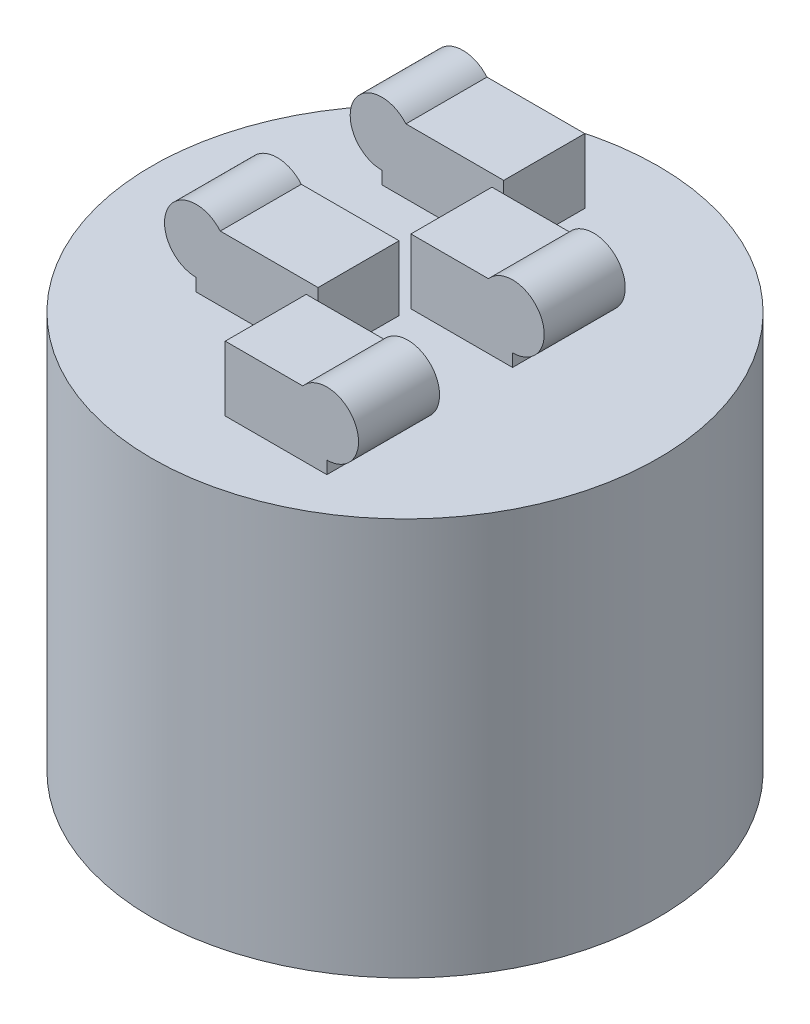
ISO-10303-21;
HEADER;
FILE_DESCRIPTION(('STEP AP214'),'2;1');
FILE_NAME('part.step','',(''),(''),'','','');
FILE_SCHEMA(('AUTOMOTIVE_DESIGN { 1 0 10303 214 1 1 1 1 }'));
ENDSEC;
DATA;
#1=APPLICATION_CONTEXT('core data for automotive mechanical design processes');
#2=APPLICATION_PROTOCOL_DEFINITION('international standard','automotive_design',2000,#1);
#3=PRODUCT_CONTEXT('',#1,'mechanical');
#4=PRODUCT('Part','Part','',(#3));
#5=PRODUCT_RELATED_PRODUCT_CATEGORY('part','',(#4));
#6=PRODUCT_DEFINITION_FORMATION('','',#4);
#7=PRODUCT_DEFINITION_CONTEXT('part definition',#1,'design');
#8=PRODUCT_DEFINITION('design','',#6,#7);
#9=PRODUCT_DEFINITION_SHAPE('','',#8);
#10=(LENGTH_UNIT() NAMED_UNIT(*) SI_UNIT(.MILLI.,.METRE.));
#11=(NAMED_UNIT(*) PLANE_ANGLE_UNIT() SI_UNIT($,.RADIAN.));
#12=(NAMED_UNIT(*) SI_UNIT($,.STERADIAN.) SOLID_ANGLE_UNIT());
#13=UNCERTAINTY_MEASURE_WITH_UNIT(LENGTH_MEASURE(1.E-05),#10,'distance_accuracy_value','');
#14=(GEOMETRIC_REPRESENTATION_CONTEXT(3) GLOBAL_UNCERTAINTY_ASSIGNED_CONTEXT((#13)) GLOBAL_UNIT_ASSIGNED_CONTEXT((#10,
#11,#12)) REPRESENTATION_CONTEXT('',''));
#15=CARTESIAN_POINT('',(0.,0.,0.));
#16=DIRECTION('',(0.,0.,1.));
#17=DIRECTION('',(1.,0.,0.));
#18=AXIS2_PLACEMENT_3D('',#15,#16,#17);
#19=CARTESIAN_POINT('',(0.,78.5,0.));
#20=DIRECTION('',(0.,1.,0.));
#21=DIRECTION('',(0.,0.,1.));
#22=AXIS2_PLACEMENT_3D('',#19,#20,#21);
#23=PLANE('',#22);
#24=DIRECTION('',(0.,0.,-1.));
#25=VECTOR('',#24,1.);
#26=CARTESIAN_POINT('',(20.07,78.5,35.495));
#27=LINE('',#26,#25);
#28=CARTESIAN_POINT('',(20.07,78.5,35.495));
#29=VERTEX_POINT('',#28);
#30=CARTESIAN_POINT('',(20.07,78.5,19.495));
#31=VERTEX_POINT('',#30);
#32=EDGE_CURVE('E242',#29,#31,#27,.T.);
#33=ORIENTED_EDGE('',*,*,#32,.F.);
#34=DIRECTION('',(1.,0.,0.));
#35=VECTOR('',#34,1.);
#36=CARTESIAN_POINT('',(0.,78.5,35.495));
#37=LINE('',#36,#35);
#38=CARTESIAN_POINT('',(0.,78.5,35.495));
#39=VERTEX_POINT('',#38);
#40=EDGE_CURVE('E214',#39,#29,#37,.T.);
#41=ORIENTED_EDGE('',*,*,#40,.F.);
#42=DIRECTION('',(0.,0.,-1.));
#43=VECTOR('',#42,1.);
#44=CARTESIAN_POINT('',(0.,78.5,35.495));
#45=LINE('',#44,#43);
#46=CARTESIAN_POINT('',(0.,78.5,19.495));
#47=VERTEX_POINT('',#46);
#48=EDGE_CURVE('E245',#39,#47,#45,.T.);
#49=ORIENTED_EDGE('',*,*,#48,.T.);
#50=DIRECTION('',(1.,0.,0.));
#51=VECTOR('',#50,1.);
#52=CARTESIAN_POINT('',(0.,78.5,19.495));
#53=LINE('',#52,#51);
#54=EDGE_CURVE('E227',#47,#31,#53,.T.);
#55=ORIENTED_EDGE('',*,*,#54,.T.);
#56=EDGE_LOOP('',(#33,#41,#49,#55));
#57=FACE_BOUND('',#56,.T.);
#58=DIRECTION('',(1.,0.,0.));
#59=VECTOR('',#58,1.);
#60=CARTESIAN_POINT('',(0.,78.5,-19.495));
#61=LINE('',#60,#59);
#62=CARTESIAN_POINT('',(-24.07,78.5,-19.495));
#63=VERTEX_POINT('',#62);
#64=CARTESIAN_POINT('',(0.,78.5,-19.495));
#65=VERTEX_POINT('',#64);
#66=EDGE_CURVE('E258',#63,#65,#61,.T.);
#67=ORIENTED_EDGE('',*,*,#66,.F.);
#68=DIRECTION('',(0.,0.,-1.));
#69=VECTOR('',#68,1.);
#70=CARTESIAN_POINT('',(-24.07,78.5,-19.495));
#71=LINE('',#70,#69);
#72=CARTESIAN_POINT('',(-24.07,78.5,-35.495));
#73=VERTEX_POINT('',#72);
#74=EDGE_CURVE('E273',#63,#73,#71,.T.);
#75=ORIENTED_EDGE('',*,*,#74,.T.);
#76=DIRECTION('',(1.,0.,0.));
#77=VECTOR('',#76,1.);
#78=CARTESIAN_POINT('',(0.,78.5,-35.495));
#79=LINE('',#78,#77);
#80=CARTESIAN_POINT('',(0.,78.5,-35.495));
#81=VERTEX_POINT('',#80);
#82=EDGE_CURVE('E252',#73,#81,#79,.T.);
#83=ORIENTED_EDGE('',*,*,#82,.T.);
#84=DIRECTION('',(0.,0.,-1.));
#85=VECTOR('',#84,1.);
#86=CARTESIAN_POINT('',(0.,78.5,-19.495));
#87=LINE('',#86,#85);
#88=EDGE_CURVE('E260',#65,#81,#87,.T.);
#89=ORIENTED_EDGE('',*,*,#88,.F.);
#90=EDGE_LOOP('',(#67,#75,#83,#89));
#91=FACE_BOUND('',#90,.T.);
#92=DIRECTION('',(1.,0.,0.));
#93=VECTOR('',#92,1.);
#94=CARTESIAN_POINT('',(0.,78.5,17.165));
#95=LINE('',#94,#93);
#96=CARTESIAN_POINT('',(-24.07,78.5,17.165));
#97=VERTEX_POINT('',#96);
#98=CARTESIAN_POINT('',(0.,78.5,17.165));
#99=VERTEX_POINT('',#98);
#100=EDGE_CURVE('E296',#97,#99,#95,.T.);
#101=ORIENTED_EDGE('',*,*,#100,.F.);
#102=DIRECTION('',(0.,0.,-1.));
#103=VECTOR('',#102,1.);
#104=CARTESIAN_POINT('',(-24.07,78.5,17.165));
#105=LINE('',#104,#103);
#106=CARTESIAN_POINT('',(-24.07,78.5,1.165));
#107=VERTEX_POINT('',#106);
#108=EDGE_CURVE('E311',#97,#107,#105,.T.);
#109=ORIENTED_EDGE('',*,*,#108,.T.);
#110=DIRECTION('',(1.,0.,0.));
#111=VECTOR('',#110,1.);
#112=CARTESIAN_POINT('',(0.,78.5,1.165));
#113=LINE('',#112,#111);
#114=CARTESIAN_POINT('',(0.,78.5,1.165));
#115=VERTEX_POINT('',#114);
#116=EDGE_CURVE('E290',#107,#115,#113,.T.);
#117=ORIENTED_EDGE('',*,*,#116,.T.);
#118=DIRECTION('',(0.,0.,-1.));
#119=VECTOR('',#118,1.);
#120=CARTESIAN_POINT('',(0.,78.5,17.165));
#121=LINE('',#120,#119);
#122=EDGE_CURVE('E298',#99,#115,#121,.T.);
#123=ORIENTED_EDGE('',*,*,#122,.F.);
#124=EDGE_LOOP('',(#101,#109,#117,#123));
#125=FACE_BOUND('',#124,.T.);
#126=CARTESIAN_POINT('',(0.,78.5,0.));
#127=DIRECTION('',(0.,1.,0.));
#128=DIRECTION('',(0.,0.,1.));
#129=AXIS2_PLACEMENT_3D('',#126,#127,#128);
#130=CIRCLE('',#129,50.);
#131=CARTESIAN_POINT('',(0.,78.5,50.));
#132=VERTEX_POINT('',#131);
#133=EDGE_CURVE('E11',#132,#132,#130,.T.);
#134=ORIENTED_EDGE('',*,*,#133,.T.);
#135=EDGE_LOOP('',(#134));
#136=FACE_BOUND('',#135,.T.);
#137=DIRECTION('',(0.,0.,-1.));
#138=VECTOR('',#137,1.);
#139=CARTESIAN_POINT('',(20.07,78.5,-1.165));
#140=LINE('',#139,#138);
#141=CARTESIAN_POINT('',(20.07,78.5,-1.165));
#142=VERTEX_POINT('',#141);
#143=CARTESIAN_POINT('',(20.07,78.5,-17.165));
#144=VERTEX_POINT('',#143);
#145=EDGE_CURVE('E53',#142,#144,#140,.T.);
#146=ORIENTED_EDGE('',*,*,#145,.F.);
#147=DIRECTION('',(1.,0.,0.));
#148=VECTOR('',#147,1.);
#149=CARTESIAN_POINT('',(0.,78.5,-1.165));
#150=LINE('',#149,#148);
#151=CARTESIAN_POINT('',(0.,78.5,-1.165));
#152=VERTEX_POINT('',#151);
#153=EDGE_CURVE('E48',#152,#142,#150,.T.);
#154=ORIENTED_EDGE('',*,*,#153,.F.);
#155=DIRECTION('',(0.,0.,-1.));
#156=VECTOR('',#155,1.);
#157=CARTESIAN_POINT('',(0.,78.5,-1.165));
#158=LINE('',#157,#156);
#159=CARTESIAN_POINT('',(0.,78.5,-17.165));
#160=VERTEX_POINT('',#159);
#161=EDGE_CURVE('E208',#152,#160,#158,.T.);
#162=ORIENTED_EDGE('',*,*,#161,.T.);
#163=DIRECTION('',(1.,0.,0.));
#164=VECTOR('',#163,1.);
#165=CARTESIAN_POINT('',(0.,78.5,-17.165));
#166=LINE('',#165,#164);
#167=EDGE_CURVE('E196',#160,#144,#166,.T.);
#168=ORIENTED_EDGE('',*,*,#167,.T.);
#169=EDGE_LOOP('',(#146,#154,#162,#168));
#170=FACE_BOUND('',#169,.T.);
#171=ADVANCED_FACE('F33',(#57,#91,#125,#136,#170),#23,.T.);
#172=CARTESIAN_POINT('',(0.,78.5,0.));
#173=DIRECTION('',(0.,-1.,0.));
#174=DIRECTION('',(0.,0.,-1.));
#175=AXIS2_PLACEMENT_3D('',#172,#173,#174);
#176=CYLINDRICAL_SURFACE('',#175,50.);
#177=ORIENTED_EDGE('',*,*,#133,.F.);
#178=EDGE_LOOP('',(#177));
#179=FACE_BOUND('',#178,.T.);
#180=CARTESIAN_POINT('',(0.,0.,0.));
#181=DIRECTION('',(0.,1.,0.));
#182=DIRECTION('',(0.,0.,1.));
#183=AXIS2_PLACEMENT_3D('',#180,#181,#182);
#184=CIRCLE('',#183,50.);
#185=CARTESIAN_POINT('',(0.,0.,50.));
#186=VERTEX_POINT('',#185);
#187=EDGE_CURVE('E37',#186,#186,#184,.T.);
#188=ORIENTED_EDGE('',*,*,#187,.T.);
#189=EDGE_LOOP('',(#188));
#190=FACE_BOUND('',#189,.T.);
#191=ADVANCED_FACE('F35',(#179,#190),#176,.T.);
#192=CARTESIAN_POINT('',(0.,0.,0.));
#193=DIRECTION('',(0.,1.,0.));
#194=DIRECTION('',(0.,0.,1.));
#195=AXIS2_PLACEMENT_3D('',#192,#193,#194);
#196=PLANE('',#195);
#197=ORIENTED_EDGE('',*,*,#187,.F.);
#198=EDGE_LOOP('',(#197));
#199=FACE_BOUND('',#198,.T.);
#200=ADVANCED_FACE('F328',(#199),#196,.F.);
#201=CARTESIAN_POINT('',(0.,78.5,17.165));
#202=DIRECTION('',(-1.,0.,0.));
#203=DIRECTION('',(0.,0.,1.));
#204=AXIS2_PLACEMENT_3D('',#201,#202,#203);
#205=PLANE('',#204);
#206=DIRECTION('',(0.,1.,0.));
#207=VECTOR('',#206,1.);
#208=CARTESIAN_POINT('',(0.,78.5,1.165));
#209=LINE('',#208,#207);
#210=CARTESIAN_POINT('',(0.,91.3,1.165));
#211=VERTEX_POINT('',#210);
#212=EDGE_CURVE('E285',#115,#211,#209,.T.);
#213=ORIENTED_EDGE('',*,*,#212,.T.);
#214=DIRECTION('',(0.,0.,-1.));
#215=VECTOR('',#214,1.);
#216=CARTESIAN_POINT('',(0.,91.3,17.165));
#217=LINE('',#216,#215);
#218=CARTESIAN_POINT('',(0.,91.3,17.165));
#219=VERTEX_POINT('',#218);
#220=EDGE_CURVE('E320',#219,#211,#217,.T.);
#221=ORIENTED_EDGE('',*,*,#220,.F.);
#222=DIRECTION('',(0.,1.,0.));
#223=VECTOR('',#222,1.);
#224=CARTESIAN_POINT('',(0.,78.5,17.165));
#225=LINE('',#224,#223);
#226=EDGE_CURVE('E286',#99,#219,#225,.T.);
#227=ORIENTED_EDGE('',*,*,#226,.F.);
#228=ORIENTED_EDGE('',*,*,#122,.T.);
#229=EDGE_LOOP('',(#213,#221,#227,#228));
#230=FACE_BOUND('',#229,.T.);
#231=ADVANCED_FACE('F330',(#230),#205,.F.);
#232=CARTESIAN_POINT('',(0.,91.3,17.165));
#233=DIRECTION('',(0.,-1.,0.));
#234=DIRECTION('',(1.,0.,0.));
#235=AXIS2_PLACEMENT_3D('',#232,#233,#234);
#236=PLANE('',#235);
#237=DIRECTION('',(-1.,0.,0.));
#238=VECTOR('',#237,1.);
#239=CARTESIAN_POINT('',(0.,91.3,1.165));
#240=LINE('',#239,#238);
#241=CARTESIAN_POINT('',(-19.3097479058352,91.3,1.165));
#242=VERTEX_POINT('',#241);
#243=EDGE_CURVE('E301',#211,#242,#240,.T.);
#244=ORIENTED_EDGE('',*,*,#243,.T.);
#245=DIRECTION('',(0.,0.,-1.));
#246=VECTOR('',#245,1.);
#247=CARTESIAN_POINT('',(-19.3097479058352,91.3,17.165));
#248=LINE('',#247,#246);
#249=CARTESIAN_POINT('',(-19.3097479058352,91.3,17.165));
#250=VERTEX_POINT('',#249);
#251=EDGE_CURVE('E317',#250,#242,#248,.T.);
#252=ORIENTED_EDGE('',*,*,#251,.F.);
#253=DIRECTION('',(-1.,0.,0.));
#254=VECTOR('',#253,1.);
#255=CARTESIAN_POINT('',(0.,91.3,17.165));
#256=LINE('',#255,#254);
#257=EDGE_CURVE('E289',#219,#250,#256,.T.);
#258=ORIENTED_EDGE('',*,*,#257,.F.);
#259=ORIENTED_EDGE('',*,*,#220,.T.);
#260=EDGE_LOOP('',(#244,#252,#258,#259));
#261=FACE_BOUND('',#260,.T.);
#262=ADVANCED_FACE('F335',(#261),#236,.F.);
#263=CARTESIAN_POINT('',(-24.07,87.25,17.165));
#264=DIRECTION('',(0.,0.,-1.));
#265=DIRECTION('',(-1.,0.,0.));
#266=AXIS2_PLACEMENT_3D('',#263,#264,#265);
#267=CYLINDRICAL_SURFACE('',#266,6.25);
#268=CARTESIAN_POINT('',(-24.07,87.25,1.165));
#269=DIRECTION('',(0.,0.,1.));
#270=DIRECTION('',(1.,0.,0.));
#271=AXIS2_PLACEMENT_3D('',#268,#269,#270);
#272=CIRCLE('',#271,6.25);
#273=CARTESIAN_POINT('',(-24.07,81.,1.165));
#274=VERTEX_POINT('',#273);
#275=EDGE_CURVE('E303',#242,#274,#272,.T.);
#276=ORIENTED_EDGE('',*,*,#275,.T.);
#277=DIRECTION('',(0.,0.,-1.));
#278=VECTOR('',#277,1.);
#279=CARTESIAN_POINT('',(-24.07,81.,17.165));
#280=LINE('',#279,#278);
#281=CARTESIAN_POINT('',(-24.07,81.,17.165));
#282=VERTEX_POINT('',#281);
#283=EDGE_CURVE('E314',#282,#274,#280,.T.);
#284=ORIENTED_EDGE('',*,*,#283,.F.);
#285=CARTESIAN_POINT('',(-24.07,87.25,17.165));
#286=DIRECTION('',(0.,0.,1.));
#287=DIRECTION('',(1.,0.,0.));
#288=AXIS2_PLACEMENT_3D('',#285,#286,#287);
#289=CIRCLE('',#288,6.25);
#290=EDGE_CURVE('E292',#250,#282,#289,.T.);
#291=ORIENTED_EDGE('',*,*,#290,.F.);
#292=ORIENTED_EDGE('',*,*,#251,.T.);
#293=EDGE_LOOP('',(#276,#284,#291,#292));
#294=FACE_BOUND('',#293,.T.);
#295=ADVANCED_FACE('F348',(#294),#267,.T.);
#296=CARTESIAN_POINT('',(-24.07,78.5,17.165));
#297=DIRECTION('',(1.,0.,0.));
#298=DIRECTION('',(0.,0.,-1.));
#299=AXIS2_PLACEMENT_3D('',#296,#297,#298);
#300=PLANE('',#299);
#301=DIRECTION('',(0.,-1.,0.));
#302=VECTOR('',#301,1.);
#303=CARTESIAN_POINT('',(-24.07,78.5,1.165));
#304=LINE('',#303,#302);
#305=EDGE_CURVE('E305',#274,#107,#304,.T.);
#306=ORIENTED_EDGE('',*,*,#305,.T.);
#307=ORIENTED_EDGE('',*,*,#108,.F.);
#308=DIRECTION('',(0.,-1.,0.));
#309=VECTOR('',#308,1.);
#310=CARTESIAN_POINT('',(-24.07,78.5,17.165));
#311=LINE('',#310,#309);
#312=EDGE_CURVE('E294',#282,#97,#311,.T.);
#313=ORIENTED_EDGE('',*,*,#312,.F.);
#314=ORIENTED_EDGE('',*,*,#283,.T.);
#315=EDGE_LOOP('',(#306,#307,#313,#314));
#316=FACE_BOUND('',#315,.T.);
#317=ADVANCED_FACE('F351',(#316),#300,.F.);
#318=CARTESIAN_POINT('',(-24.07,87.25,17.165));
#319=DIRECTION('',(0.,0.,1.));
#320=DIRECTION('',(1.,0.,0.));
#321=AXIS2_PLACEMENT_3D('',#318,#319,#320);
#322=PLANE('',#321);
#323=ORIENTED_EDGE('',*,*,#226,.T.);
#324=ORIENTED_EDGE('',*,*,#257,.T.);
#325=ORIENTED_EDGE('',*,*,#290,.T.);
#326=ORIENTED_EDGE('',*,*,#312,.T.);
#327=ORIENTED_EDGE('',*,*,#100,.T.);
#328=EDGE_LOOP('',(#323,#324,#325,#326,#327));
#329=FACE_BOUND('',#328,.T.);
#330=ADVANCED_FACE('F355',(#329),#322,.T.);
#331=CARTESIAN_POINT('',(-24.07,87.25,1.165));
#332=DIRECTION('',(0.,0.,1.));
#333=DIRECTION('',(1.,0.,0.));
#334=AXIS2_PLACEMENT_3D('',#331,#332,#333);
#335=PLANE('',#334);
#336=ORIENTED_EDGE('',*,*,#212,.F.);
#337=ORIENTED_EDGE('',*,*,#116,.F.);
#338=ORIENTED_EDGE('',*,*,#305,.F.);
#339=ORIENTED_EDGE('',*,*,#275,.F.);
#340=ORIENTED_EDGE('',*,*,#243,.F.);
#341=EDGE_LOOP('',(#336,#337,#338,#339,#340));
#342=FACE_BOUND('',#341,.T.);
#343=ADVANCED_FACE('F357',(#342),#335,.F.);
#344=CARTESIAN_POINT('',(0.,78.5,-19.495));
#345=DIRECTION('',(-1.,0.,0.));
#346=DIRECTION('',(0.,0.,1.));
#347=AXIS2_PLACEMENT_3D('',#344,#345,#346);
#348=PLANE('',#347);
#349=DIRECTION('',(0.,1.,0.));
#350=VECTOR('',#349,1.);
#351=CARTESIAN_POINT('',(0.,78.5,-35.495));
#352=LINE('',#351,#350);
#353=CARTESIAN_POINT('',(0.,91.3,-35.495));
#354=VERTEX_POINT('',#353);
#355=EDGE_CURVE('E247',#81,#354,#352,.T.);
#356=ORIENTED_EDGE('',*,*,#355,.T.);
#357=DIRECTION('',(0.,0.,-1.));
#358=VECTOR('',#357,1.);
#359=CARTESIAN_POINT('',(0.,91.3,-19.495));
#360=LINE('',#359,#358);
#361=CARTESIAN_POINT('',(0.,91.3,-19.495));
#362=VERTEX_POINT('',#361);
#363=EDGE_CURVE('E282',#362,#354,#360,.T.);
#364=ORIENTED_EDGE('',*,*,#363,.F.);
#365=DIRECTION('',(0.,1.,0.));
#366=VECTOR('',#365,1.);
#367=CARTESIAN_POINT('',(0.,78.5,-19.495));
#368=LINE('',#367,#366);
#369=EDGE_CURVE('E248',#65,#362,#368,.T.);
#370=ORIENTED_EDGE('',*,*,#369,.F.);
#371=ORIENTED_EDGE('',*,*,#88,.T.);
#372=EDGE_LOOP('',(#356,#364,#370,#371));
#373=FACE_BOUND('',#372,.T.);
#374=ADVANCED_FACE('F360',(#373),#348,.F.);
#375=CARTESIAN_POINT('',(0.,91.3,-19.495));
#376=DIRECTION('',(0.,-1.,0.));
#377=DIRECTION('',(1.,0.,0.));
#378=AXIS2_PLACEMENT_3D('',#375,#376,#377);
#379=PLANE('',#378);
#380=DIRECTION('',(-1.,0.,0.));
#381=VECTOR('',#380,1.);
#382=CARTESIAN_POINT('',(0.,91.3,-35.495));
#383=LINE('',#382,#381);
#384=CARTESIAN_POINT('',(-19.3097479058352,91.3,-35.495));
#385=VERTEX_POINT('',#384);
#386=EDGE_CURVE('E263',#354,#385,#383,.T.);
#387=ORIENTED_EDGE('',*,*,#386,.T.);
#388=DIRECTION('',(0.,0.,-1.));
#389=VECTOR('',#388,1.);
#390=CARTESIAN_POINT('',(-19.3097479058352,91.3,-19.495));
#391=LINE('',#390,#389);
#392=CARTESIAN_POINT('',(-19.3097479058352,91.3,-19.495));
#393=VERTEX_POINT('',#392);
#394=EDGE_CURVE('E279',#393,#385,#391,.T.);
#395=ORIENTED_EDGE('',*,*,#394,.F.);
#396=DIRECTION('',(-1.,0.,0.));
#397=VECTOR('',#396,1.);
#398=CARTESIAN_POINT('',(0.,91.3,-19.495));
#399=LINE('',#398,#397);
#400=EDGE_CURVE('E251',#362,#393,#399,.T.);
#401=ORIENTED_EDGE('',*,*,#400,.F.);
#402=ORIENTED_EDGE('',*,*,#363,.T.);
#403=EDGE_LOOP('',(#387,#395,#401,#402));
#404=FACE_BOUND('',#403,.T.);
#405=ADVANCED_FACE('F367',(#404),#379,.F.);
#406=CARTESIAN_POINT('',(-24.07,87.25,-19.495));
#407=DIRECTION('',(0.,0.,-1.));
#408=DIRECTION('',(-1.,0.,0.));
#409=AXIS2_PLACEMENT_3D('',#406,#407,#408);
#410=CYLINDRICAL_SURFACE('',#409,6.25);
#411=CARTESIAN_POINT('',(-24.07,87.25,-35.495));
#412=DIRECTION('',(0.,0.,1.));
#413=DIRECTION('',(1.,0.,0.));
#414=AXIS2_PLACEMENT_3D('',#411,#412,#413);
#415=CIRCLE('',#414,6.25);
#416=CARTESIAN_POINT('',(-24.07,81.,-35.495));
#417=VERTEX_POINT('',#416);
#418=EDGE_CURVE('E265',#385,#417,#415,.T.);
#419=ORIENTED_EDGE('',*,*,#418,.T.);
#420=DIRECTION('',(0.,0.,-1.));
#421=VECTOR('',#420,1.);
#422=CARTESIAN_POINT('',(-24.07,81.,-19.495));
#423=LINE('',#422,#421);
#424=CARTESIAN_POINT('',(-24.07,81.,-19.495));
#425=VERTEX_POINT('',#424);
#426=EDGE_CURVE('E276',#425,#417,#423,.T.);
#427=ORIENTED_EDGE('',*,*,#426,.F.);
#428=CARTESIAN_POINT('',(-24.07,87.25,-19.495));
#429=DIRECTION('',(0.,0.,1.));
#430=DIRECTION('',(1.,0.,0.));
#431=AXIS2_PLACEMENT_3D('',#428,#429,#430);
#432=CIRCLE('',#431,6.25);
#433=EDGE_CURVE('E254',#393,#425,#432,.T.);
#434=ORIENTED_EDGE('',*,*,#433,.F.);
#435=ORIENTED_EDGE('',*,*,#394,.T.);
#436=EDGE_LOOP('',(#419,#427,#434,#435));
#437=FACE_BOUND('',#436,.T.);
#438=ADVANCED_FACE('F371',(#437),#410,.T.);
#439=CARTESIAN_POINT('',(-24.07,78.5,-19.495));
#440=DIRECTION('',(1.,0.,0.));
#441=DIRECTION('',(0.,0.,-1.));
#442=AXIS2_PLACEMENT_3D('',#439,#440,#441);
#443=PLANE('',#442);
#444=DIRECTION('',(0.,-1.,0.));
#445=VECTOR('',#444,1.);
#446=CARTESIAN_POINT('',(-24.07,78.5,-35.495));
#447=LINE('',#446,#445);
#448=EDGE_CURVE('E267',#417,#73,#447,.T.);
#449=ORIENTED_EDGE('',*,*,#448,.T.);
#450=ORIENTED_EDGE('',*,*,#74,.F.);
#451=DIRECTION('',(0.,-1.,0.));
#452=VECTOR('',#451,1.);
#453=CARTESIAN_POINT('',(-24.07,78.5,-19.495));
#454=LINE('',#453,#452);
#455=EDGE_CURVE('E256',#425,#63,#454,.T.);
#456=ORIENTED_EDGE('',*,*,#455,.F.);
#457=ORIENTED_EDGE('',*,*,#426,.T.);
#458=EDGE_LOOP('',(#449,#450,#456,#457));
#459=FACE_BOUND('',#458,.T.);
#460=ADVANCED_FACE('F375',(#459),#443,.F.);
#461=CARTESIAN_POINT('',(-24.07,87.25,-19.495));
#462=DIRECTION('',(0.,0.,1.));
#463=DIRECTION('',(1.,0.,0.));
#464=AXIS2_PLACEMENT_3D('',#461,#462,#463);
#465=PLANE('',#464);
#466=ORIENTED_EDGE('',*,*,#369,.T.);
#467=ORIENTED_EDGE('',*,*,#400,.T.);
#468=ORIENTED_EDGE('',*,*,#433,.T.);
#469=ORIENTED_EDGE('',*,*,#455,.T.);
#470=ORIENTED_EDGE('',*,*,#66,.T.);
#471=EDGE_LOOP('',(#466,#467,#468,#469,#470));
#472=FACE_BOUND('',#471,.T.);
#473=ADVANCED_FACE('F379',(#472),#465,.T.);
#474=CARTESIAN_POINT('',(-24.07,87.25,-35.495));
#475=DIRECTION('',(0.,0.,1.));
#476=DIRECTION('',(1.,0.,0.));
#477=AXIS2_PLACEMENT_3D('',#474,#475,#476);
#478=PLANE('',#477);
#479=ORIENTED_EDGE('',*,*,#355,.F.);
#480=ORIENTED_EDGE('',*,*,#82,.F.);
#481=ORIENTED_EDGE('',*,*,#448,.F.);
#482=ORIENTED_EDGE('',*,*,#418,.F.);
#483=ORIENTED_EDGE('',*,*,#386,.F.);
#484=EDGE_LOOP('',(#479,#480,#481,#482,#483));
#485=FACE_BOUND('',#484,.T.);
#486=ADVANCED_FACE('F381',(#485),#478,.F.);
#487=CARTESIAN_POINT('',(0.,78.5,35.495));
#488=DIRECTION('',(1.,0.,0.));
#489=DIRECTION('',(0.,0.,-1.));
#490=AXIS2_PLACEMENT_3D('',#487,#488,#489);
#491=PLANE('',#490);
#492=DIRECTION('',(0.,-1.,0.));
#493=VECTOR('',#492,1.);
#494=CARTESIAN_POINT('',(0.,78.5,19.495));
#495=LINE('',#494,#493);
#496=CARTESIAN_POINT('',(0.,91.3,19.495));
#497=VERTEX_POINT('',#496);
#498=EDGE_CURVE('E210',#497,#47,#495,.T.);
#499=ORIENTED_EDGE('',*,*,#498,.T.);
#500=ORIENTED_EDGE('',*,*,#48,.F.);
#501=DIRECTION('',(0.,-1.,0.));
#502=VECTOR('',#501,1.);
#503=CARTESIAN_POINT('',(0.,78.5,35.495));
#504=LINE('',#503,#502);
#505=CARTESIAN_POINT('',(0.,91.3,35.495));
#506=VERTEX_POINT('',#505);
#507=EDGE_CURVE('E211',#506,#39,#504,.T.);
#508=ORIENTED_EDGE('',*,*,#507,.F.);
#509=DIRECTION('',(0.,0.,-1.));
#510=VECTOR('',#509,1.);
#511=CARTESIAN_POINT('',(0.,91.3,35.495));
#512=LINE('',#511,#510);
#513=EDGE_CURVE('E224',#506,#497,#512,.T.);
#514=ORIENTED_EDGE('',*,*,#513,.T.);
#515=EDGE_LOOP('',(#499,#500,#508,#514));
#516=FACE_BOUND('',#515,.T.);
#517=ADVANCED_FACE('F384',(#516),#491,.F.);
#518=CARTESIAN_POINT('',(20.07,78.5,35.495));
#519=DIRECTION('',(-1.,0.,0.));
#520=DIRECTION('',(0.,0.,1.));
#521=AXIS2_PLACEMENT_3D('',#518,#519,#520);
#522=PLANE('',#521);
#523=DIRECTION('',(0.,1.,0.));
#524=VECTOR('',#523,1.);
#525=CARTESIAN_POINT('',(20.07,78.5,19.495));
#526=LINE('',#525,#524);
#527=CARTESIAN_POINT('',(20.07,81.,19.495));
#528=VERTEX_POINT('',#527);
#529=EDGE_CURVE('E229',#31,#528,#526,.T.);
#530=ORIENTED_EDGE('',*,*,#529,.T.);
#531=DIRECTION('',(0.,0.,-1.));
#532=VECTOR('',#531,1.);
#533=CARTESIAN_POINT('',(20.07,81.,35.495));
#534=LINE('',#533,#532);
#535=CARTESIAN_POINT('',(20.07,81.,35.495));
#536=VERTEX_POINT('',#535);
#537=EDGE_CURVE('E239',#536,#528,#534,.T.);
#538=ORIENTED_EDGE('',*,*,#537,.F.);
#539=DIRECTION('',(0.,1.,0.));
#540=VECTOR('',#539,1.);
#541=CARTESIAN_POINT('',(20.07,78.5,35.495));
#542=LINE('',#541,#540);
#543=EDGE_CURVE('E218',#29,#536,#542,.T.);
#544=ORIENTED_EDGE('',*,*,#543,.F.);
#545=ORIENTED_EDGE('',*,*,#32,.T.);
#546=EDGE_LOOP('',(#530,#538,#544,#545));
#547=FACE_BOUND('',#546,.T.);
#548=ADVANCED_FACE('F391',(#547),#522,.F.);
#549=CARTESIAN_POINT('',(20.07,87.25,35.495));
#550=DIRECTION('',(0.,0.,-1.));
#551=DIRECTION('',(-1.,0.,0.));
#552=AXIS2_PLACEMENT_3D('',#549,#550,#551);
#553=CYLINDRICAL_SURFACE('',#552,6.25);
#554=CARTESIAN_POINT('',(20.07,87.25,19.495));
#555=DIRECTION('',(0.,0.,1.));
#556=DIRECTION('',(-1.,0.,0.));
#557=AXIS2_PLACEMENT_3D('',#554,#555,#556);
#558=CIRCLE('',#557,6.25);
#559=CARTESIAN_POINT('',(15.3097479058352,91.3,19.495));
#560=VERTEX_POINT('',#559);
#561=EDGE_CURVE('E231',#528,#560,#558,.T.);
#562=ORIENTED_EDGE('',*,*,#561,.T.);
#563=DIRECTION('',(0.,0.,-1.));
#564=VECTOR('',#563,1.);
#565=CARTESIAN_POINT('',(15.3097479058352,91.3,35.495));
#566=LINE('',#565,#564);
#567=CARTESIAN_POINT('',(15.3097479058352,91.3,35.495));
#568=VERTEX_POINT('',#567);
#569=EDGE_CURVE('E236',#568,#560,#566,.T.);
#570=ORIENTED_EDGE('',*,*,#569,.F.);
#571=CARTESIAN_POINT('',(20.07,87.25,35.495));
#572=DIRECTION('',(0.,0.,1.));
#573=DIRECTION('',(-1.,0.,0.));
#574=AXIS2_PLACEMENT_3D('',#571,#572,#573);
#575=CIRCLE('',#574,6.25);
#576=EDGE_CURVE('E220',#536,#568,#575,.T.);
#577=ORIENTED_EDGE('',*,*,#576,.F.);
#578=ORIENTED_EDGE('',*,*,#537,.T.);
#579=EDGE_LOOP('',(#562,#570,#577,#578));
#580=FACE_BOUND('',#579,.T.);
#581=ADVANCED_FACE('F395',(#580),#553,.T.);
#582=CARTESIAN_POINT('',(0.,91.3,35.495));
#583=DIRECTION('',(0.,-1.,0.));
#584=DIRECTION('',(0.,0.,-1.));
#585=AXIS2_PLACEMENT_3D('',#582,#583,#584);
#586=PLANE('',#585);
#587=DIRECTION('',(-1.,0.,0.));
#588=VECTOR('',#587,1.);
#589=CARTESIAN_POINT('',(0.,91.3,19.495));
#590=LINE('',#589,#588);
#591=EDGE_CURVE('E215',#560,#497,#590,.T.);
#592=ORIENTED_EDGE('',*,*,#591,.T.);
#593=ORIENTED_EDGE('',*,*,#513,.F.);
#594=DIRECTION('',(-1.,0.,0.));
#595=VECTOR('',#594,1.);
#596=CARTESIAN_POINT('',(0.,91.3,35.495));
#597=LINE('',#596,#595);
#598=EDGE_CURVE('E222',#568,#506,#597,.T.);
#599=ORIENTED_EDGE('',*,*,#598,.F.);
#600=ORIENTED_EDGE('',*,*,#569,.T.);
#601=EDGE_LOOP('',(#592,#593,#599,#600));
#602=FACE_BOUND('',#601,.T.);
#603=ADVANCED_FACE('F399',(#602),#586,.F.);
#604=CARTESIAN_POINT('',(20.07,87.25,35.495));
#605=DIRECTION('',(0.,0.,-1.));
#606=DIRECTION('',(-1.,0.,0.));
#607=AXIS2_PLACEMENT_3D('',#604,#605,#606);
#608=PLANE('',#607);
#609=ORIENTED_EDGE('',*,*,#507,.T.);
#610=ORIENTED_EDGE('',*,*,#40,.T.);
#611=ORIENTED_EDGE('',*,*,#543,.T.);
#612=ORIENTED_EDGE('',*,*,#576,.T.);
#613=ORIENTED_EDGE('',*,*,#598,.T.);
#614=EDGE_LOOP('',(#609,#610,#611,#612,#613));
#615=FACE_BOUND('',#614,.T.);
#616=ADVANCED_FACE('F403',(#615),#608,.F.);
#617=CARTESIAN_POINT('',(20.07,87.25,19.495));
#618=DIRECTION('',(0.,0.,-1.));
#619=DIRECTION('',(-1.,0.,0.));
#620=AXIS2_PLACEMENT_3D('',#617,#618,#619);
#621=PLANE('',#620);
#622=ORIENTED_EDGE('',*,*,#498,.F.);
#623=ORIENTED_EDGE('',*,*,#591,.F.);
#624=ORIENTED_EDGE('',*,*,#561,.F.);
#625=ORIENTED_EDGE('',*,*,#529,.F.);
#626=ORIENTED_EDGE('',*,*,#54,.F.);
#627=EDGE_LOOP('',(#622,#623,#624,#625,#626));
#628=FACE_BOUND('',#627,.T.);
#629=ADVANCED_FACE('F405',(#628),#621,.T.);
#630=CARTESIAN_POINT('',(0.,78.5,-1.165));
#631=DIRECTION('',(1.,0.,0.));
#632=DIRECTION('',(0.,0.,-1.));
#633=AXIS2_PLACEMENT_3D('',#630,#631,#632);
#634=PLANE('',#633);
#635=DIRECTION('',(0.,-1.,0.));
#636=VECTOR('',#635,1.);
#637=CARTESIAN_POINT('',(0.,78.5,-17.165));
#638=LINE('',#637,#636);
#639=CARTESIAN_POINT('',(0.,91.3,-17.165));
#640=VERTEX_POINT('',#639);
#641=EDGE_CURVE('E193',#640,#160,#638,.T.);
#642=ORIENTED_EDGE('',*,*,#641,.T.);
#643=ORIENTED_EDGE('',*,*,#161,.F.);
#644=DIRECTION('',(0.,-1.,0.));
#645=VECTOR('',#644,1.);
#646=CARTESIAN_POINT('',(0.,78.5,-1.165));
#647=LINE('',#646,#645);
#648=CARTESIAN_POINT('',(0.,91.3,-1.165));
#649=VERTEX_POINT('',#648);
#650=EDGE_CURVE('E203',#649,#152,#647,.T.);
#651=ORIENTED_EDGE('',*,*,#650,.F.);
#652=DIRECTION('',(0.,0.,-1.));
#653=VECTOR('',#652,1.);
#654=CARTESIAN_POINT('',(0.,91.3,-1.165));
#655=LINE('',#654,#653);
#656=EDGE_CURVE('E189',#649,#640,#655,.T.);
#657=ORIENTED_EDGE('',*,*,#656,.T.);
#658=EDGE_LOOP('',(#642,#643,#651,#657));
#659=FACE_BOUND('',#658,.T.);
#660=ADVANCED_FACE('F408',(#659),#634,.F.);
#661=CARTESIAN_POINT('',(20.07,78.5,-1.165));
#662=DIRECTION('',(-1.,0.,0.));
#663=DIRECTION('',(0.,0.,1.));
#664=AXIS2_PLACEMENT_3D('',#661,#662,#663);
#665=PLANE('',#664);
#666=DIRECTION('',(0.,1.,0.));
#667=VECTOR('',#666,1.);
#668=CARTESIAN_POINT('',(20.07,78.5,-17.165));
#669=LINE('',#668,#667);
#670=CARTESIAN_POINT('',(20.07,81.,-17.165));
#671=VERTEX_POINT('',#670);
#672=EDGE_CURVE('E179',#144,#671,#669,.T.);
#673=ORIENTED_EDGE('',*,*,#672,.T.);
#674=DIRECTION('',(0.,0.,-1.));
#675=VECTOR('',#674,1.);
#676=CARTESIAN_POINT('',(20.07,81.,-1.165));
#677=LINE('',#676,#675);
#678=CARTESIAN_POINT('',(20.07,81.,-1.165));
#679=VERTEX_POINT('',#678);
#680=EDGE_CURVE('E176',#679,#671,#677,.T.);
#681=ORIENTED_EDGE('',*,*,#680,.F.);
#682=DIRECTION('',(0.,1.,0.));
#683=VECTOR('',#682,1.);
#684=CARTESIAN_POINT('',(20.07,78.5,-1.165));
#685=LINE('',#684,#683);
#686=EDGE_CURVE('E167',#142,#679,#685,.T.);
#687=ORIENTED_EDGE('',*,*,#686,.F.);
#688=ORIENTED_EDGE('',*,*,#145,.T.);
#689=EDGE_LOOP('',(#673,#681,#687,#688));
#690=FACE_BOUND('',#689,.T.);
#691=ADVANCED_FACE('F177',(#690),#665,.F.);
#692=CARTESIAN_POINT('',(20.07,87.25,-1.165));
#693=DIRECTION('',(0.,0.,-1.));
#694=DIRECTION('',(-1.,0.,0.));
#695=AXIS2_PLACEMENT_3D('',#692,#693,#694);
#696=CYLINDRICAL_SURFACE('',#695,6.25);
#697=CARTESIAN_POINT('',(20.07,87.25,-17.165));
#698=DIRECTION('',(0.,0.,1.));
#699=DIRECTION('',(-1.,0.,0.));
#700=AXIS2_PLACEMENT_3D('',#697,#698,#699);
#701=CIRCLE('',#700,6.25);
#702=CARTESIAN_POINT('',(15.3097479058352,91.3,-17.165));
#703=VERTEX_POINT('',#702);
#704=EDGE_CURVE('E199',#671,#703,#701,.T.);
#705=ORIENTED_EDGE('',*,*,#704,.T.);
#706=DIRECTION('',(0.,0.,-1.));
#707=VECTOR('',#706,1.);
#708=CARTESIAN_POINT('',(15.3097479058352,91.3,-1.165));
#709=LINE('',#708,#707);
#710=CARTESIAN_POINT('',(15.3097479058352,91.3,-1.165));
#711=VERTEX_POINT('',#710);
#712=EDGE_CURVE('E182',#711,#703,#709,.T.);
#713=ORIENTED_EDGE('',*,*,#712,.F.);
#714=CARTESIAN_POINT('',(20.07,87.25,-1.165));
#715=DIRECTION('',(0.,0.,1.));
#716=DIRECTION('',(-1.,0.,0.));
#717=AXIS2_PLACEMENT_3D('',#714,#715,#716);
#718=CIRCLE('',#717,6.25);
#719=EDGE_CURVE('E171',#679,#711,#718,.T.);
#720=ORIENTED_EDGE('',*,*,#719,.F.);
#721=ORIENTED_EDGE('',*,*,#680,.T.);
#722=EDGE_LOOP('',(#705,#713,#720,#721));
#723=FACE_BOUND('',#722,.T.);
#724=ADVANCED_FACE('F184',(#723),#696,.T.);
#725=CARTESIAN_POINT('',(0.,91.3,-1.165));
#726=DIRECTION('',(0.,-1.,0.));
#727=DIRECTION('',(0.,0.,-1.));
#728=AXIS2_PLACEMENT_3D('',#725,#726,#727);
#729=PLANE('',#728);
#730=DIRECTION('',(-1.,0.,0.));
#731=VECTOR('',#730,1.);
#732=CARTESIAN_POINT('',(0.,91.3,-17.165));
#733=LINE('',#732,#731);
#734=EDGE_CURVE('E201',#703,#640,#733,.T.);
#735=ORIENTED_EDGE('',*,*,#734,.T.);
#736=ORIENTED_EDGE('',*,*,#656,.F.);
#737=DIRECTION('',(-1.,0.,0.));
#738=VECTOR('',#737,1.);
#739=CARTESIAN_POINT('',(0.,91.3,-1.165));
#740=LINE('',#739,#738);
#741=EDGE_CURVE('E187',#711,#649,#740,.T.);
#742=ORIENTED_EDGE('',*,*,#741,.F.);
#743=ORIENTED_EDGE('',*,*,#712,.T.);
#744=EDGE_LOOP('',(#735,#736,#742,#743));
#745=FACE_BOUND('',#744,.T.);
#746=ADVANCED_FACE('F420',(#745),#729,.F.);
#747=CARTESIAN_POINT('',(20.07,87.25,-1.165));
#748=DIRECTION('',(0.,0.,-1.));
#749=DIRECTION('',(-1.,0.,0.));
#750=AXIS2_PLACEMENT_3D('',#747,#748,#749);
#751=PLANE('',#750);
#752=ORIENTED_EDGE('',*,*,#650,.T.);
#753=ORIENTED_EDGE('',*,*,#153,.T.);
#754=ORIENTED_EDGE('',*,*,#686,.T.);
#755=ORIENTED_EDGE('',*,*,#719,.T.);
#756=ORIENTED_EDGE('',*,*,#741,.T.);
#757=EDGE_LOOP('',(#752,#753,#754,#755,#756));
#758=FACE_BOUND('',#757,.T.);
#759=ADVANCED_FACE('F169',(#758),#751,.F.);
#760=CARTESIAN_POINT('',(20.07,87.25,-17.165));
#761=DIRECTION('',(0.,0.,-1.));
#762=DIRECTION('',(-1.,0.,0.));
#763=AXIS2_PLACEMENT_3D('',#760,#761,#762);
#764=PLANE('',#763);
#765=ORIENTED_EDGE('',*,*,#641,.F.);
#766=ORIENTED_EDGE('',*,*,#734,.F.);
#767=ORIENTED_EDGE('',*,*,#704,.F.);
#768=ORIENTED_EDGE('',*,*,#672,.F.);
#769=ORIENTED_EDGE('',*,*,#167,.F.);
#770=EDGE_LOOP('',(#765,#766,#767,#768,#769));
#771=FACE_BOUND('',#770,.T.);
#772=ADVANCED_FACE('F424',(#771),#764,.T.);
#773=CLOSED_SHELL('',(#171,#191,#200,#231,#262,#295,#317,#330,#343,#374,#405,#438,#460,#473,
#486,#517,#548,#581,#603,#616,#629,#660,#691,#724,#746,#759,#772));
#774=MANIFOLD_SOLID_BREP('B2',#773);
#775=ADVANCED_BREP_SHAPE_REPRESENTATION('',(#18,#774),#14);
#776=SHAPE_DEFINITION_REPRESENTATION(#9,#775);
ENDSEC;
END-ISO-10303-21;
